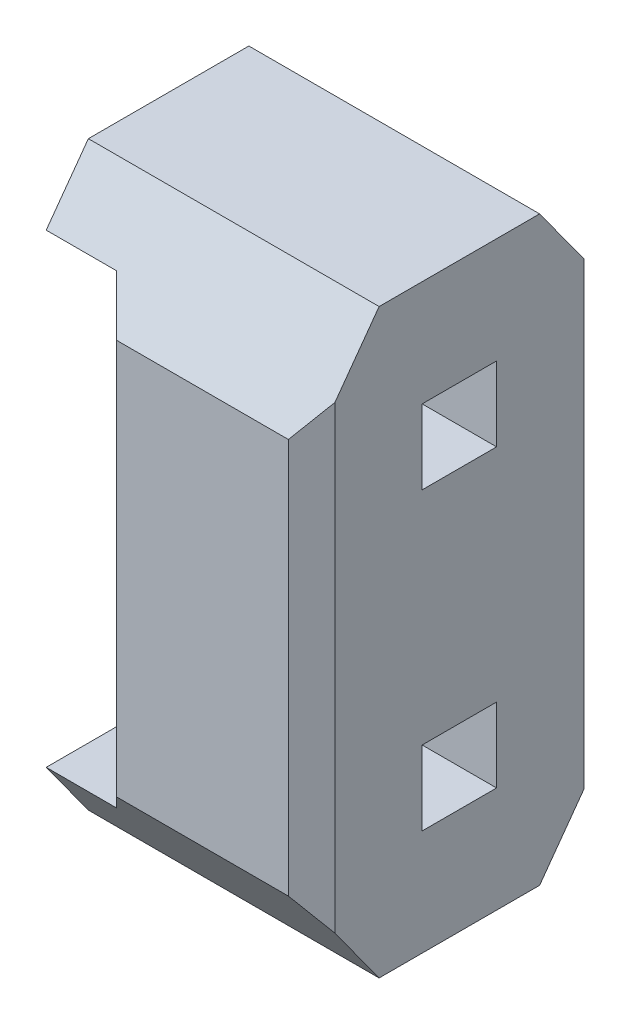
ISO-10303-21;
HEADER;
FILE_DESCRIPTION(('STEP AP214'),'2;1');
FILE_NAME('part.step','',(''),(''),'','','');
FILE_SCHEMA(('AUTOMOTIVE_DESIGN { 1 0 10303 214 1 1 1 1 }'));
ENDSEC;
DATA;
#1=APPLICATION_CONTEXT('core data for automotive mechanical design processes');
#2=APPLICATION_PROTOCOL_DEFINITION('international standard','automotive_design',2000,#1);
#3=PRODUCT_CONTEXT('',#1,'mechanical');
#4=PRODUCT('Part','Part','',(#3));
#5=PRODUCT_RELATED_PRODUCT_CATEGORY('part','',(#4));
#6=PRODUCT_DEFINITION_FORMATION('','',#4);
#7=PRODUCT_DEFINITION_CONTEXT('part definition',#1,'design');
#8=PRODUCT_DEFINITION('design','',#6,#7);
#9=PRODUCT_DEFINITION_SHAPE('','',#8);
#10=(LENGTH_UNIT() NAMED_UNIT(*) SI_UNIT(.MILLI.,.METRE.));
#11=(NAMED_UNIT(*) PLANE_ANGLE_UNIT() SI_UNIT($,.RADIAN.));
#12=(NAMED_UNIT(*) SI_UNIT($,.STERADIAN.) SOLID_ANGLE_UNIT());
#13=UNCERTAINTY_MEASURE_WITH_UNIT(LENGTH_MEASURE(1.E-05),#10,'distance_accuracy_value','');
#14=(GEOMETRIC_REPRESENTATION_CONTEXT(3) GLOBAL_UNCERTAINTY_ASSIGNED_CONTEXT((#13)) GLOBAL_UNIT_ASSIGNED_CONTEXT((#10,
#11,#12)) REPRESENTATION_CONTEXT('',''));
#15=CARTESIAN_POINT('',(0.,0.,0.));
#16=DIRECTION('',(0.,0.,1.));
#17=DIRECTION('',(1.,0.,0.));
#18=AXIS2_PLACEMENT_3D('',#15,#16,#17);
#19=CARTESIAN_POINT('',(1.25,4.6,-48.55));
#20=DIRECTION('',(0.,0.586967571460905,0.809610443394407));
#21=DIRECTION('',(0.,-0.809610443394407,0.586967571460905));
#22=AXIS2_PLACEMENT_3D('',#19,#20,#21);
#23=PLANE('',#22);
#24=DIRECTION('',(1.,0.,0.));
#25=VECTOR('',#24,1.);
#26=CARTESIAN_POINT('',(1.25,4.5,-48.4775));
#27=LINE('',#26,#25);
#28=CARTESIAN_POINT('',(0.,4.5,-48.4775));
#29=VERTEX_POINT('',#28);
#30=CARTESIAN_POINT('',(0.602500000000325,4.5,-48.4775000000001));
#31=VERTEX_POINT('',#30);
#32=EDGE_CURVE('E199',#29,#31,#27,.T.);
#33=ORIENTED_EDGE('',*,*,#32,.T.);
#34=DIRECTION('',(0.506207656348697,-0.698217457033984,0.506207656349602));
#35=VECTOR('',#34,1.);
#36=CARTESIAN_POINT('',(0.6025000000002,4.5,-48.4775));
#37=LINE('',#36,#35);
#38=CARTESIAN_POINT('',(0.819999999999671,4.2,-48.2599999999999));
#39=VERTEX_POINT('',#38);
#40=EDGE_CURVE('E197',#31,#39,#37,.T.);
#41=ORIENTED_EDGE('',*,*,#40,.T.);
#42=DIRECTION('',(1.,0.,0.));
#43=VECTOR('',#42,1.);
#44=CARTESIAN_POINT('',(1.25,4.19999999999999,-48.26));
#45=LINE('',#44,#43);
#46=CARTESIAN_POINT('',(2.30000000000012,4.2,-48.2599999999999));
#47=VERTEX_POINT('',#46);
#48=EDGE_CURVE('E20',#39,#47,#45,.T.);
#49=ORIENTED_EDGE('',*,*,#48,.T.);
#50=DIRECTION('',(0.506207656348954,0.698217457033861,-0.506207656349513));
#51=VECTOR('',#50,1.);
#52=CARTESIAN_POINT('',(2.3,4.19999999999999,-48.26));
#53=LINE('',#52,#51);
#54=CARTESIAN_POINT('',(2.49999999999988,4.47586206896592,-48.4600000000002));
#55=VERTEX_POINT('',#54);
#56=EDGE_CURVE('E181',#47,#55,#53,.T.);
#57=ORIENTED_EDGE('',*,*,#56,.T.);
#58=DIRECTION('',(0.,-0.809610443394407,0.586967571460905));
#59=VECTOR('',#58,1.);
#60=CARTESIAN_POINT('',(2.5,4.6,-48.55));
#61=LINE('',#60,#59);
#62=CARTESIAN_POINT('',(2.5,5.00000000000001,-48.84));
#63=VERTEX_POINT('',#62);
#64=EDGE_CURVE('E188',#55,#63,#61,.F.);
#65=ORIENTED_EDGE('',*,*,#64,.T.);
#66=DIRECTION('',(1.,0.,0.));
#67=VECTOR('',#66,1.);
#68=CARTESIAN_POINT('',(1.25,5.,-48.84));
#69=LINE('',#68,#67);
#70=CARTESIAN_POINT('',(0.,5.00000000000001,-48.84));
#71=VERTEX_POINT('',#70);
#72=EDGE_CURVE('E215',#71,#63,#69,.T.);
#73=ORIENTED_EDGE('',*,*,#72,.F.);
#74=DIRECTION('',(0.,-0.809610443394407,0.586967571460905));
#75=VECTOR('',#74,1.);
#76=CARTESIAN_POINT('',(0.,4.6,-48.55));
#77=LINE('',#76,#75);
#78=EDGE_CURVE('E207',#71,#29,#77,.T.);
#79=ORIENTED_EDGE('',*,*,#78,.T.);
#80=EDGE_LOOP('',(#33,#41,#49,#57,#65,#73,#79));
#81=FACE_BOUND('',#80,.T.);
#82=ADVANCED_FACE('F17',(#81),#23,.T.);
#83=CARTESIAN_POINT('',(1.25,4.6,-50.51));
#84=DIRECTION('',(0.,-0.586967571460905,0.809610443394407));
#85=DIRECTION('',(0.,-0.809610443394407,-0.586967571460905));
#86=AXIS2_PLACEMENT_3D('',#83,#84,#85);
#87=PLANE('',#86);
#88=DIRECTION('',(0.,-0.809610443394407,-0.586967571460905));
#89=VECTOR('',#88,1.);
#90=CARTESIAN_POINT('',(0.,4.6,-50.51));
#91=LINE('',#90,#89);
#92=CARTESIAN_POINT('',(0.,5.,-50.22));
#93=VERTEX_POINT('',#92);
#94=CARTESIAN_POINT('',(0.,4.5,-50.5825));
#95=VERTEX_POINT('',#94);
#96=EDGE_CURVE('E263',#93,#95,#91,.T.);
#97=ORIENTED_EDGE('',*,*,#96,.F.);
#98=DIRECTION('',(1.,0.,0.));
#99=VECTOR('',#98,1.);
#100=CARTESIAN_POINT('',(1.25,5.,-50.22));
#101=LINE('',#100,#99);
#102=CARTESIAN_POINT('',(2.5,5.,-50.22));
#103=VERTEX_POINT('',#102);
#104=EDGE_CURVE('E227',#103,#93,#101,.F.);
#105=ORIENTED_EDGE('',*,*,#104,.F.);
#106=DIRECTION('',(0.,-0.809610443394407,-0.586967571460905));
#107=VECTOR('',#106,1.);
#108=CARTESIAN_POINT('',(2.5,4.6,-50.51));
#109=LINE('',#108,#107);
#110=CARTESIAN_POINT('',(2.49999999999988,4.47586206896592,-50.5999999999998));
#111=VERTEX_POINT('',#110);
#112=EDGE_CURVE('E223',#111,#103,#109,.F.);
#113=ORIENTED_EDGE('',*,*,#112,.F.);
#114=DIRECTION('',(0.506207656348957,0.698217457033858,0.506207656349515));
#115=VECTOR('',#114,1.);
#116=CARTESIAN_POINT('',(2.3,4.19999999999999,-50.8));
#117=LINE('',#116,#115);
#118=CARTESIAN_POINT('',(2.30000000000012,4.2,-50.8000000000001));
#119=VERTEX_POINT('',#118);
#120=EDGE_CURVE('E266',#119,#111,#117,.T.);
#121=ORIENTED_EDGE('',*,*,#120,.F.);
#122=DIRECTION('',(1.,0.,0.));
#123=VECTOR('',#122,1.);
#124=CARTESIAN_POINT('',(1.25,4.19999999999999,-50.8));
#125=LINE('',#124,#123);
#126=CARTESIAN_POINT('',(0.819999999999671,4.2,-50.8000000000001));
#127=VERTEX_POINT('',#126);
#128=EDGE_CURVE('E205',#127,#119,#125,.T.);
#129=ORIENTED_EDGE('',*,*,#128,.F.);
#130=DIRECTION('',(0.506207656348699,-0.698217457033982,-0.506207656349603));
#131=VECTOR('',#130,1.);
#132=CARTESIAN_POINT('',(0.6025000000002,4.5,-50.5825));
#133=LINE('',#132,#131);
#134=CARTESIAN_POINT('',(0.602500000000326,4.5,-50.5824999999999));
#135=VERTEX_POINT('',#134);
#136=EDGE_CURVE('E203',#135,#127,#133,.T.);
#137=ORIENTED_EDGE('',*,*,#136,.F.);
#138=DIRECTION('',(1.,0.,0.));
#139=VECTOR('',#138,1.);
#140=CARTESIAN_POINT('',(1.25,4.5,-50.5825));
#141=LINE('',#140,#139);
#142=EDGE_CURVE('E261',#95,#135,#141,.T.);
#143=ORIENTED_EDGE('',*,*,#142,.F.);
#144=EDGE_LOOP('',(#97,#105,#113,#121,#129,#137,#143));
#145=FACE_BOUND('',#144,.T.);
#146=ADVANCED_FACE('F285',(#145),#87,.F.);
#147=CARTESIAN_POINT('',(1.25,0.4,-50.51));
#148=DIRECTION('',(0.,0.586967571460905,0.809610443394407));
#149=DIRECTION('',(0.,-0.809610443394407,0.586967571460905));
#150=AXIS2_PLACEMENT_3D('',#147,#148,#149);
#151=PLANE('',#150);
#152=DIRECTION('',(-0.506207656349409,0.698217457033648,-0.506207656349353));
#153=VECTOR('',#152,1.);
#154=CARTESIAN_POINT('',(2.5,0.524137931034498,-50.6));
#155=LINE('',#154,#153);
#156=CARTESIAN_POINT('',(2.49999999999988,0.5241379310345,-50.5999999999999));
#157=VERTEX_POINT('',#156);
#158=CARTESIAN_POINT('',(2.30000000000012,0.800000000000004,-50.8000000000001));
#159=VERTEX_POINT('',#158);
#160=EDGE_CURVE('E251',#157,#159,#155,.T.);
#161=ORIENTED_EDGE('',*,*,#160,.F.);
#162=DIRECTION('',(0.,-0.809610443394407,0.586967571460905));
#163=VECTOR('',#162,1.);
#164=CARTESIAN_POINT('',(2.5,0.4,-50.51));
#165=LINE('',#164,#163);
#166=CARTESIAN_POINT('',(2.5,0.,-50.22));
#167=VERTEX_POINT('',#166);
#168=EDGE_CURVE('E253',#167,#157,#165,.F.);
#169=ORIENTED_EDGE('',*,*,#168,.F.);
#170=DIRECTION('',(1.,0.,0.));
#171=VECTOR('',#170,1.);
#172=CARTESIAN_POINT('',(1.25,0.,-50.22));
#173=LINE('',#172,#171);
#174=CARTESIAN_POINT('',(0.,0.,-50.22));
#175=VERTEX_POINT('',#174);
#176=EDGE_CURVE('E288',#167,#175,#173,.F.);
#177=ORIENTED_EDGE('',*,*,#176,.T.);
#178=DIRECTION('',(0.,-0.809610443394407,0.586967571460905));
#179=VECTOR('',#178,1.);
#180=CARTESIAN_POINT('',(0.,0.4,-50.51));
#181=LINE('',#180,#179);
#182=CARTESIAN_POINT('',(0.,0.500000000000001,-50.5825));
#183=VERTEX_POINT('',#182);
#184=EDGE_CURVE('E255',#183,#175,#181,.T.);
#185=ORIENTED_EDGE('',*,*,#184,.F.);
#186=DIRECTION('',(1.,0.,0.));
#187=VECTOR('',#186,1.);
#188=CARTESIAN_POINT('',(1.25,0.500000000000003,-50.5825));
#189=LINE('',#188,#187);
#190=CARTESIAN_POINT('',(0.602500000000326,0.500000000000002,-50.5824999999999));
#191=VERTEX_POINT('',#190);
#192=EDGE_CURVE('E257',#191,#183,#189,.F.);
#193=ORIENTED_EDGE('',*,*,#192,.F.);
#194=DIRECTION('',(-0.506207656348698,-0.698217457033982,0.506207656349602));
#195=VECTOR('',#194,1.);
#196=CARTESIAN_POINT('',(0.8199999999998,0.800000000000008,-50.8));
#197=LINE('',#196,#195);
#198=CARTESIAN_POINT('',(0.819999999999671,0.800000000000004,-50.8000000000001));
#199=VERTEX_POINT('',#198);
#200=EDGE_CURVE('E259',#199,#191,#197,.T.);
#201=ORIENTED_EDGE('',*,*,#200,.F.);
#202=DIRECTION('',(1.,0.,0.));
#203=VECTOR('',#202,1.);
#204=CARTESIAN_POINT('',(1.25,0.800000000000008,-50.8));
#205=LINE('',#204,#203);
#206=EDGE_CURVE('E249',#159,#199,#205,.F.);
#207=ORIENTED_EDGE('',*,*,#206,.F.);
#208=EDGE_LOOP('',(#161,#169,#177,#185,#193,#201,#207));
#209=FACE_BOUND('',#208,.T.);
#210=ADVANCED_FACE('F431',(#209),#151,.F.);
#211=CARTESIAN_POINT('',(1.25,0.4,-48.55));
#212=DIRECTION('',(0.,-0.586967571460905,0.809610443394407));
#213=DIRECTION('',(0.,-0.809610443394407,-0.586967571460905));
#214=AXIS2_PLACEMENT_3D('',#211,#212,#213);
#215=PLANE('',#214);
#216=DIRECTION('',(1.,0.,0.));
#217=VECTOR('',#216,1.);
#218=CARTESIAN_POINT('',(1.25,0.800000000000008,-48.26));
#219=LINE('',#218,#217);
#220=CARTESIAN_POINT('',(2.30000000000012,0.800000000000004,-48.2599999999999));
#221=VERTEX_POINT('',#220);
#222=CARTESIAN_POINT('',(0.819999999999671,0.800000000000004,-48.2599999999999));
#223=VERTEX_POINT('',#222);
#224=EDGE_CURVE('E191',#221,#223,#219,.F.);
#225=ORIENTED_EDGE('',*,*,#224,.T.);
#226=DIRECTION('',(-0.506207656348696,-0.698217457033985,-0.506207656349601));
#227=VECTOR('',#226,1.);
#228=CARTESIAN_POINT('',(0.8199999999998,0.800000000000008,-48.26));
#229=LINE('',#228,#227);
#230=CARTESIAN_POINT('',(0.602500000000324,0.5,-48.4775000000001));
#231=VERTEX_POINT('',#230);
#232=EDGE_CURVE('E232',#223,#231,#229,.T.);
#233=ORIENTED_EDGE('',*,*,#232,.T.);
#234=DIRECTION('',(1.,0.,0.));
#235=VECTOR('',#234,1.);
#236=CARTESIAN_POINT('',(1.25,0.500000000000001,-48.4775));
#237=LINE('',#236,#235);
#238=CARTESIAN_POINT('',(0.,0.5,-48.4775));
#239=VERTEX_POINT('',#238);
#240=EDGE_CURVE('E246',#231,#239,#237,.F.);
#241=ORIENTED_EDGE('',*,*,#240,.T.);
#242=DIRECTION('',(0.,-0.809610443394407,-0.586967571460905));
#243=VECTOR('',#242,1.);
#244=CARTESIAN_POINT('',(0.,0.4,-48.55));
#245=LINE('',#244,#243);
#246=CARTESIAN_POINT('',(0.,0.,-48.84));
#247=VERTEX_POINT('',#246);
#248=EDGE_CURVE('E244',#239,#247,#245,.T.);
#249=ORIENTED_EDGE('',*,*,#248,.T.);
#250=DIRECTION('',(1.,0.,0.));
#251=VECTOR('',#250,1.);
#252=CARTESIAN_POINT('',(1.25,0.,-48.84));
#253=LINE('',#252,#251);
#254=CARTESIAN_POINT('',(2.5,0.,-48.84));
#255=VERTEX_POINT('',#254);
#256=EDGE_CURVE('E293',#247,#255,#253,.T.);
#257=ORIENTED_EDGE('',*,*,#256,.T.);
#258=DIRECTION('',(0.,-0.809610443394407,-0.586967571460905));
#259=VECTOR('',#258,1.);
#260=CARTESIAN_POINT('',(2.5,0.4,-48.55));
#261=LINE('',#260,#259);
#262=CARTESIAN_POINT('',(2.49999999999988,0.524137931034496,-48.4600000000001));
#263=VERTEX_POINT('',#262);
#264=EDGE_CURVE('E241',#255,#263,#261,.F.);
#265=ORIENTED_EDGE('',*,*,#264,.T.);
#266=DIRECTION('',(-0.5062076563494,0.698217457033649,0.506207656349361));
#267=VECTOR('',#266,1.);
#268=CARTESIAN_POINT('',(2.5,0.524137931034493,-48.46));
#269=LINE('',#268,#267);
#270=EDGE_CURVE('E239',#263,#221,#269,.T.);
#271=ORIENTED_EDGE('',*,*,#270,.T.);
#272=EDGE_LOOP('',(#225,#233,#241,#249,#257,#265,#271));
#273=FACE_BOUND('',#272,.T.);
#274=ADVANCED_FACE('F421',(#273),#215,.T.);
#275=CARTESIAN_POINT('',(1.25,5.,-49.53));
#276=DIRECTION('',(0.,1.,0.));
#277=DIRECTION('',(0.,0.,1.));
#278=AXIS2_PLACEMENT_3D('',#275,#276,#277);
#279=PLANE('',#278);
#280=ORIENTED_EDGE('',*,*,#104,.T.);
#281=DIRECTION('',(0.,0.,-1.));
#282=VECTOR('',#281,1.);
#283=CARTESIAN_POINT('',(0.,5.,-49.53));
#284=LINE('',#283,#282);
#285=EDGE_CURVE('E231',#93,#71,#284,.F.);
#286=ORIENTED_EDGE('',*,*,#285,.T.);
#287=ORIENTED_EDGE('',*,*,#72,.T.);
#288=DIRECTION('',(0.,0.,1.));
#289=VECTOR('',#288,1.);
#290=CARTESIAN_POINT('',(2.5,5.,-49.53));
#291=LINE('',#290,#289);
#292=EDGE_CURVE('E219',#63,#103,#291,.F.);
#293=ORIENTED_EDGE('',*,*,#292,.T.);
#294=EDGE_LOOP('',(#280,#286,#287,#293));
#295=FACE_BOUND('',#294,.T.);
#296=ADVANCED_FACE('F229',(#295),#279,.T.);
#297=CARTESIAN_POINT('',(1.25,0.,-49.53));
#298=DIRECTION('',(0.,1.,0.));
#299=DIRECTION('',(0.,0.,1.));
#300=AXIS2_PLACEMENT_3D('',#297,#298,#299);
#301=PLANE('',#300);
#302=DIRECTION('',(0.,0.,-1.));
#303=VECTOR('',#302,1.);
#304=CARTESIAN_POINT('',(0.,0.,-49.53));
#305=LINE('',#304,#303);
#306=EDGE_CURVE('E297',#247,#175,#305,.T.);
#307=ORIENTED_EDGE('',*,*,#306,.T.);
#308=ORIENTED_EDGE('',*,*,#176,.F.);
#309=DIRECTION('',(0.,0.,1.));
#310=VECTOR('',#309,1.);
#311=CARTESIAN_POINT('',(2.5,0.,-49.53));
#312=LINE('',#311,#310);
#313=EDGE_CURVE('E287',#255,#167,#312,.F.);
#314=ORIENTED_EDGE('',*,*,#313,.F.);
#315=ORIENTED_EDGE('',*,*,#256,.F.);
#316=EDGE_LOOP('',(#307,#308,#314,#315));
#317=FACE_BOUND('',#316,.T.);
#318=ADVANCED_FACE('F428',(#317),#301,.F.);
#319=CARTESIAN_POINT('',(0.,4.75,-49.53));
#320=DIRECTION('',(1.,0.,0.));
#321=DIRECTION('',(0.,0.,-1.));
#322=AXIS2_PLACEMENT_3D('',#319,#320,#321);
#323=PLANE('',#322);
#324=ORIENTED_EDGE('',*,*,#285,.F.);
#325=ORIENTED_EDGE('',*,*,#96,.T.);
#326=DIRECTION('',(0.,0.,1.));
#327=VECTOR('',#326,1.);
#328=CARTESIAN_POINT('',(0.,4.5,-49.53));
#329=LINE('',#328,#327);
#330=EDGE_CURVE('E307',#95,#29,#329,.T.);
#331=ORIENTED_EDGE('',*,*,#330,.T.);
#332=ORIENTED_EDGE('',*,*,#78,.F.);
#333=EDGE_LOOP('',(#324,#325,#331,#332));
#334=FACE_BOUND('',#333,.T.);
#335=ADVANCED_FACE('F441',(#334),#323,.F.);
#336=CARTESIAN_POINT('',(0.,0.25,-49.53));
#337=DIRECTION('',(1.,0.,0.));
#338=DIRECTION('',(0.,0.,-1.));
#339=AXIS2_PLACEMENT_3D('',#336,#337,#338);
#340=PLANE('',#339);
#341=ORIENTED_EDGE('',*,*,#306,.F.);
#342=ORIENTED_EDGE('',*,*,#248,.F.);
#343=DIRECTION('',(0.,0.,1.));
#344=VECTOR('',#343,1.);
#345=CARTESIAN_POINT('',(0.,0.5,-49.53));
#346=LINE('',#345,#344);
#347=EDGE_CURVE('E315',#183,#239,#346,.T.);
#348=ORIENTED_EDGE('',*,*,#347,.F.);
#349=ORIENTED_EDGE('',*,*,#184,.T.);
#350=EDGE_LOOP('',(#341,#342,#348,#349));
#351=FACE_BOUND('',#350,.T.);
#352=ADVANCED_FACE('F443',(#351),#340,.F.);
#353=CARTESIAN_POINT('',(1.55,3.45,-49.53));
#354=DIRECTION('',(0.,1.,0.));
#355=DIRECTION('',(0.,0.,1.));
#356=AXIS2_PLACEMENT_3D('',#353,#354,#355);
#357=PLANE('',#356);
#358=DIRECTION('',(1.,0.,0.));
#359=VECTOR('',#358,1.);
#360=CARTESIAN_POINT('',(1.55,3.45,-49.85));
#361=LINE('',#360,#359);
#362=CARTESIAN_POINT('',(0.6,3.45,-49.85));
#363=VERTEX_POINT('',#362);
#364=CARTESIAN_POINT('',(2.5,3.45,-49.85));
#365=VERTEX_POINT('',#364);
#366=EDGE_CURVE('E332',#363,#365,#361,.T.);
#367=ORIENTED_EDGE('',*,*,#366,.F.);
#368=DIRECTION('',(0.,0.,1.));
#369=VECTOR('',#368,1.);
#370=CARTESIAN_POINT('',(0.6,3.45,-49.53));
#371=LINE('',#370,#369);
#372=CARTESIAN_POINT('',(0.6,3.45,-49.21));
#373=VERTEX_POINT('',#372);
#374=EDGE_CURVE('E302',#363,#373,#371,.T.);
#375=ORIENTED_EDGE('',*,*,#374,.T.);
#376=DIRECTION('',(1.,0.,0.));
#377=VECTOR('',#376,1.);
#378=CARTESIAN_POINT('',(1.55,3.45,-49.21));
#379=LINE('',#378,#377);
#380=CARTESIAN_POINT('',(2.5,3.45,-49.21));
#381=VERTEX_POINT('',#380);
#382=EDGE_CURVE('E327',#373,#381,#379,.T.);
#383=ORIENTED_EDGE('',*,*,#382,.T.);
#384=DIRECTION('',(0.,0.,1.));
#385=VECTOR('',#384,1.);
#386=CARTESIAN_POINT('',(2.5,3.45,-49.53));
#387=LINE('',#386,#385);
#388=EDGE_CURVE('E300',#381,#365,#387,.F.);
#389=ORIENTED_EDGE('',*,*,#388,.T.);
#390=EDGE_LOOP('',(#367,#375,#383,#389));
#391=FACE_BOUND('',#390,.T.);
#392=ADVANCED_FACE('F398',(#391),#357,.T.);
#393=CARTESIAN_POINT('',(0.71,2.5,-50.69));
#394=DIRECTION('',(0.707106781190498,0.,0.707106781182598));
#395=DIRECTION('',(0.707106781182598,0.,-0.707106781190498));
#396=AXIS2_PLACEMENT_3D('',#393,#394,#395);
#397=PLANE('',#396);
#398=ORIENTED_EDGE('',*,*,#200,.T.);
#399=DIRECTION('',(0.70710678118618,0.,-0.707106781186916));
#400=VECTOR('',#399,1.);
#401=CARTESIAN_POINT('',(0.6000000000002,0.5,-50.58));
#402=LINE('',#401,#400);
#403=CARTESIAN_POINT('',(0.600000000000408,0.5,-50.5799999999997));
#404=VERTEX_POINT('',#403);
#405=EDGE_CURVE('E312',#404,#191,#402,.T.);
#406=ORIENTED_EDGE('',*,*,#405,.F.);
#407=DIRECTION('',(0.,1.,0.));
#408=VECTOR('',#407,1.);
#409=CARTESIAN_POINT('',(0.6,2.5,-50.58));
#410=LINE('',#409,#408);
#411=CARTESIAN_POINT('',(0.600000000000408,4.5,-50.5799999999997));
#412=VERTEX_POINT('',#411);
#413=EDGE_CURVE('E337',#404,#412,#410,.T.);
#414=ORIENTED_EDGE('',*,*,#413,.T.);
#415=DIRECTION('',(0.70710678118618,0.,-0.707106781186916));
#416=VECTOR('',#415,1.);
#417=CARTESIAN_POINT('',(0.6000000000002,4.5,-50.58));
#418=LINE('',#417,#416);
#419=EDGE_CURVE('E304',#412,#135,#418,.T.);
#420=ORIENTED_EDGE('',*,*,#419,.T.);
#421=ORIENTED_EDGE('',*,*,#136,.T.);
#422=DIRECTION('',(0.,1.,0.));
#423=VECTOR('',#422,1.);
#424=CARTESIAN_POINT('',(0.8199999999998,2.5,-50.8));
#425=LINE('',#424,#423);
#426=EDGE_CURVE('E275',#127,#199,#425,.F.);
#427=ORIENTED_EDGE('',*,*,#426,.T.);
#428=EDGE_LOOP('',(#398,#406,#414,#420,#421,#427));
#429=FACE_BOUND('',#428,.T.);
#430=ADVANCED_FACE('F435',(#429),#397,.F.);
#431=CARTESIAN_POINT('',(0.30125,4.5,-49.53));
#432=DIRECTION('',(0.,1.,0.));
#433=DIRECTION('',(0.,0.,1.));
#434=AXIS2_PLACEMENT_3D('',#431,#432,#433);
#435=PLANE('',#434);
#436=ORIENTED_EDGE('',*,*,#142,.T.);
#437=ORIENTED_EDGE('',*,*,#419,.F.);
#438=DIRECTION('',(0.,0.,-1.));
#439=VECTOR('',#438,1.);
#440=CARTESIAN_POINT('',(0.6,4.5,-49.53));
#441=LINE('',#440,#439);
#442=CARTESIAN_POINT('',(0.600000000000279,4.5,-48.4800000000001));
#443=VERTEX_POINT('',#442);
#444=EDGE_CURVE('E339',#412,#443,#441,.F.);
#445=ORIENTED_EDGE('',*,*,#444,.T.);
#446=DIRECTION('',(-0.707106781182598,0.,-0.707106781190498));
#447=VECTOR('',#446,1.);
#448=CARTESIAN_POINT('',(0.71,4.5,-48.37));
#449=LINE('',#448,#447);
#450=EDGE_CURVE('E310',#443,#31,#449,.F.);
#451=ORIENTED_EDGE('',*,*,#450,.T.);
#452=ORIENTED_EDGE('',*,*,#32,.F.);
#453=ORIENTED_EDGE('',*,*,#330,.F.);
#454=EDGE_LOOP('',(#436,#437,#445,#451,#452,#453));
#455=FACE_BOUND('',#454,.T.);
#456=ADVANCED_FACE('F439',(#455),#435,.F.);
#457=CARTESIAN_POINT('',(0.71,2.5,-48.37));
#458=DIRECTION('',(0.707106781190498,0.,-0.707106781182598));
#459=DIRECTION('',(-0.707106781182598,0.,-0.707106781190498));
#460=AXIS2_PLACEMENT_3D('',#457,#458,#459);
#461=PLANE('',#460);
#462=ORIENTED_EDGE('',*,*,#232,.F.);
#463=DIRECTION('',(0.,1.,0.));
#464=VECTOR('',#463,1.);
#465=CARTESIAN_POINT('',(0.8199999999998,2.5,-48.26));
#466=LINE('',#465,#464);
#467=EDGE_CURVE('E325',#39,#223,#466,.F.);
#468=ORIENTED_EDGE('',*,*,#467,.F.);
#469=ORIENTED_EDGE('',*,*,#40,.F.);
#470=ORIENTED_EDGE('',*,*,#450,.F.);
#471=DIRECTION('',(0.,1.,0.));
#472=VECTOR('',#471,1.);
#473=CARTESIAN_POINT('',(0.6,2.5,-48.48));
#474=LINE('',#473,#472);
#475=CARTESIAN_POINT('',(0.600000000000408,0.5,-48.4800000000003));
#476=VERTEX_POINT('',#475);
#477=EDGE_CURVE('E341',#443,#476,#474,.F.);
#478=ORIENTED_EDGE('',*,*,#477,.T.);
#479=DIRECTION('',(-0.707106781187161,0.,-0.707106781185934));
#480=VECTOR('',#479,1.);
#481=CARTESIAN_POINT('',(0.6025000000002,0.5,-48.4775));
#482=LINE('',#481,#480);
#483=EDGE_CURVE('E318',#231,#476,#482,.T.);
#484=ORIENTED_EDGE('',*,*,#483,.F.);
#485=EDGE_LOOP('',(#462,#468,#469,#470,#478,#484));
#486=FACE_BOUND('',#485,.T.);
#487=ADVANCED_FACE('F416',(#486),#461,.F.);
#488=CARTESIAN_POINT('',(0.30125,0.5,-49.53));
#489=DIRECTION('',(0.,1.,0.));
#490=DIRECTION('',(0.,0.,1.));
#491=AXIS2_PLACEMENT_3D('',#488,#489,#490);
#492=PLANE('',#491);
#493=ORIENTED_EDGE('',*,*,#483,.T.);
#494=DIRECTION('',(0.,0.,-1.));
#495=VECTOR('',#494,1.);
#496=CARTESIAN_POINT('',(0.6,0.5,-49.53));
#497=LINE('',#496,#495);
#498=EDGE_CURVE('E343',#476,#404,#497,.T.);
#499=ORIENTED_EDGE('',*,*,#498,.T.);
#500=ORIENTED_EDGE('',*,*,#405,.T.);
#501=ORIENTED_EDGE('',*,*,#192,.T.);
#502=ORIENTED_EDGE('',*,*,#347,.T.);
#503=ORIENTED_EDGE('',*,*,#240,.F.);
#504=EDGE_LOOP('',(#493,#499,#500,#501,#502,#503));
#505=FACE_BOUND('',#504,.T.);
#506=ADVANCED_FACE('F418',(#505),#492,.T.);
#507=CARTESIAN_POINT('',(1.55,1.23,-49.85));
#508=DIRECTION('',(0.,0.,1.));
#509=DIRECTION('',(1.,0.,0.));
#510=AXIS2_PLACEMENT_3D('',#507,#508,#509);
#511=PLANE('',#510);
#512=DIRECTION('',(1.,0.,0.));
#513=VECTOR('',#512,1.);
#514=CARTESIAN_POINT('',(1.55,1.55,-49.85));
#515=LINE('',#514,#513);
#516=CARTESIAN_POINT('',(2.5,1.55,-49.85));
#517=VERTEX_POINT('',#516);
#518=CARTESIAN_POINT('',(0.6,1.55,-49.85));
#519=VERTEX_POINT('',#518);
#520=EDGE_CURVE('E283',#517,#519,#515,.F.);
#521=ORIENTED_EDGE('',*,*,#520,.T.);
#522=DIRECTION('',(0.,1.,0.));
#523=VECTOR('',#522,1.);
#524=CARTESIAN_POINT('',(0.6,2.5,-49.85));
#525=LINE('',#524,#523);
#526=CARTESIAN_POINT('',(0.6,0.91,-49.85));
#527=VERTEX_POINT('',#526);
#528=EDGE_CURVE('E346',#519,#527,#525,.F.);
#529=ORIENTED_EDGE('',*,*,#528,.T.);
#530=DIRECTION('',(1.,0.,0.));
#531=VECTOR('',#530,1.);
#532=CARTESIAN_POINT('',(1.55,0.91,-49.85));
#533=LINE('',#532,#531);
#534=CARTESIAN_POINT('',(2.5,0.91,-49.85));
#535=VERTEX_POINT('',#534);
#536=EDGE_CURVE('E354',#535,#527,#533,.F.);
#537=ORIENTED_EDGE('',*,*,#536,.F.);
#538=DIRECTION('',(0.,1.,0.));
#539=VECTOR('',#538,1.);
#540=CARTESIAN_POINT('',(2.5,1.23,-49.85));
#541=LINE('',#540,#539);
#542=EDGE_CURVE('E321',#535,#517,#541,.T.);
#543=ORIENTED_EDGE('',*,*,#542,.T.);
#544=EDGE_LOOP('',(#521,#529,#537,#543));
#545=FACE_BOUND('',#544,.T.);
#546=ADVANCED_FACE('F483',(#545),#511,.T.);
#547=CARTESIAN_POINT('',(1.56,2.5,-50.8));
#548=DIRECTION('',(0.,0.,1.));
#549=DIRECTION('',(1.,0.,0.));
#550=AXIS2_PLACEMENT_3D('',#547,#548,#549);
#551=PLANE('',#550);
#552=DIRECTION('',(0.,1.,0.));
#553=VECTOR('',#552,1.);
#554=CARTESIAN_POINT('',(2.30000000000047,2.5,-50.8000000000005));
#555=LINE('',#554,#553);
#556=EDGE_CURVE('E193',#159,#119,#555,.T.);
#557=ORIENTED_EDGE('',*,*,#556,.F.);
#558=ORIENTED_EDGE('',*,*,#206,.T.);
#559=ORIENTED_EDGE('',*,*,#426,.F.);
#560=ORIENTED_EDGE('',*,*,#128,.T.);
#561=EDGE_LOOP('',(#557,#558,#559,#560));
#562=FACE_BOUND('',#561,.T.);
#563=ADVANCED_FACE('F272',(#562),#551,.F.);
#564=CARTESIAN_POINT('',(1.56,2.5,-48.26));
#565=DIRECTION('',(0.,0.,1.));
#566=DIRECTION('',(1.,0.,0.));
#567=AXIS2_PLACEMENT_3D('',#564,#565,#566);
#568=PLANE('',#567);
#569=ORIENTED_EDGE('',*,*,#48,.F.);
#570=ORIENTED_EDGE('',*,*,#467,.T.);
#571=ORIENTED_EDGE('',*,*,#224,.F.);
#572=DIRECTION('',(0.,1.,0.));
#573=VECTOR('',#572,1.);
#574=CARTESIAN_POINT('',(2.30000000000047,2.5,-48.2599999999995));
#575=LINE('',#574,#573);
#576=EDGE_CURVE('E183',#47,#221,#575,.F.);
#577=ORIENTED_EDGE('',*,*,#576,.F.);
#578=EDGE_LOOP('',(#569,#570,#571,#577));
#579=FACE_BOUND('',#578,.T.);
#580=ADVANCED_FACE('F189',(#579),#568,.T.);
#581=CARTESIAN_POINT('',(1.55,3.77,-49.21));
#582=DIRECTION('',(0.,0.,1.));
#583=DIRECTION('',(1.,0.,0.));
#584=AXIS2_PLACEMENT_3D('',#581,#582,#583);
#585=PLANE('',#584);
#586=DIRECTION('',(0.,1.,0.));
#587=VECTOR('',#586,1.);
#588=CARTESIAN_POINT('',(2.5,3.77,-49.21));
#589=LINE('',#588,#587);
#590=CARTESIAN_POINT('',(2.5,4.09,-49.21));
#591=VERTEX_POINT('',#590);
#592=EDGE_CURVE('E330',#381,#591,#589,.T.);
#593=ORIENTED_EDGE('',*,*,#592,.F.);
#594=ORIENTED_EDGE('',*,*,#382,.F.);
#595=DIRECTION('',(0.,1.,0.));
#596=VECTOR('',#595,1.);
#597=CARTESIAN_POINT('',(0.6,2.5,-49.21));
#598=LINE('',#597,#596);
#599=CARTESIAN_POINT('',(0.6,4.09,-49.21));
#600=VERTEX_POINT('',#599);
#601=EDGE_CURVE('E351',#373,#600,#598,.T.);
#602=ORIENTED_EDGE('',*,*,#601,.T.);
#603=DIRECTION('',(1.,0.,0.));
#604=VECTOR('',#603,1.);
#605=CARTESIAN_POINT('',(1.55,4.09,-49.21));
#606=LINE('',#605,#604);
#607=EDGE_CURVE('E368',#600,#591,#606,.T.);
#608=ORIENTED_EDGE('',*,*,#607,.T.);
#609=EDGE_LOOP('',(#593,#594,#602,#608));
#610=FACE_BOUND('',#609,.T.);
#611=ADVANCED_FACE('F402',(#610),#585,.F.);
#612=CARTESIAN_POINT('',(1.55,3.77,-49.85));
#613=DIRECTION('',(0.,0.,1.));
#614=DIRECTION('',(1.,0.,0.));
#615=AXIS2_PLACEMENT_3D('',#612,#613,#614);
#616=PLANE('',#615);
#617=DIRECTION('',(1.,0.,0.));
#618=VECTOR('',#617,1.);
#619=CARTESIAN_POINT('',(1.55,4.09,-49.85));
#620=LINE('',#619,#618);
#621=CARTESIAN_POINT('',(2.5,4.09,-49.85));
#622=VERTEX_POINT('',#621);
#623=CARTESIAN_POINT('',(0.6,4.09,-49.85));
#624=VERTEX_POINT('',#623);
#625=EDGE_CURVE('E371',#622,#624,#620,.F.);
#626=ORIENTED_EDGE('',*,*,#625,.T.);
#627=DIRECTION('',(0.,1.,0.));
#628=VECTOR('',#627,1.);
#629=CARTESIAN_POINT('',(0.6,2.5,-49.85));
#630=LINE('',#629,#628);
#631=EDGE_CURVE('E348',#624,#363,#630,.F.);
#632=ORIENTED_EDGE('',*,*,#631,.T.);
#633=ORIENTED_EDGE('',*,*,#366,.T.);
#634=DIRECTION('',(0.,1.,0.));
#635=VECTOR('',#634,1.);
#636=CARTESIAN_POINT('',(2.5,3.77,-49.85));
#637=LINE('',#636,#635);
#638=EDGE_CURVE('E335',#365,#622,#637,.T.);
#639=ORIENTED_EDGE('',*,*,#638,.T.);
#640=EDGE_LOOP('',(#626,#632,#633,#639));
#641=FACE_BOUND('',#640,.T.);
#642=ADVANCED_FACE('F395',(#641),#616,.T.);
#643=CARTESIAN_POINT('',(0.6,2.5,-49.53));
#644=DIRECTION('',(1.,0.,0.));
#645=DIRECTION('',(0.,0.,-1.));
#646=AXIS2_PLACEMENT_3D('',#643,#644,#645);
#647=PLANE('',#646);
#648=ORIENTED_EDGE('',*,*,#374,.F.);
#649=ORIENTED_EDGE('',*,*,#631,.F.);
#650=DIRECTION('',(0.,0.,1.));
#651=VECTOR('',#650,1.);
#652=CARTESIAN_POINT('',(0.6,4.09,-49.53));
#653=LINE('',#652,#651);
#654=EDGE_CURVE('E192',#624,#600,#653,.T.);
#655=ORIENTED_EDGE('',*,*,#654,.T.);
#656=ORIENTED_EDGE('',*,*,#601,.F.);
#657=EDGE_LOOP('',(#648,#649,#655,#656));
#658=FACE_BOUND('',#657,.T.);
#659=ORIENTED_EDGE('',*,*,#528,.F.);
#660=DIRECTION('',(0.,0.,1.));
#661=VECTOR('',#660,1.);
#662=CARTESIAN_POINT('',(0.6,1.55,-49.53));
#663=LINE('',#662,#661);
#664=CARTESIAN_POINT('',(0.6,1.55,-49.21));
#665=VERTEX_POINT('',#664);
#666=EDGE_CURVE('E360',#519,#665,#663,.T.);
#667=ORIENTED_EDGE('',*,*,#666,.T.);
#668=DIRECTION('',(0.,1.,0.));
#669=VECTOR('',#668,1.);
#670=CARTESIAN_POINT('',(0.6,1.23,-49.21));
#671=LINE('',#670,#669);
#672=CARTESIAN_POINT('',(0.6,0.91,-49.21));
#673=VERTEX_POINT('',#672);
#674=EDGE_CURVE('E374',#665,#673,#671,.F.);
#675=ORIENTED_EDGE('',*,*,#674,.T.);
#676=DIRECTION('',(0.,0.,1.));
#677=VECTOR('',#676,1.);
#678=CARTESIAN_POINT('',(0.6,0.91,-49.53));
#679=LINE('',#678,#677);
#680=EDGE_CURVE('E357',#527,#673,#679,.T.);
#681=ORIENTED_EDGE('',*,*,#680,.F.);
#682=EDGE_LOOP('',(#659,#667,#675,#681));
#683=FACE_BOUND('',#682,.T.);
#684=ORIENTED_EDGE('',*,*,#477,.F.);
#685=ORIENTED_EDGE('',*,*,#444,.F.);
#686=ORIENTED_EDGE('',*,*,#413,.F.);
#687=ORIENTED_EDGE('',*,*,#498,.F.);
#688=EDGE_LOOP('',(#684,#685,#686,#687));
#689=FACE_BOUND('',#688,.T.);
#690=ADVANCED_FACE('F404',(#658,#683,#689),#647,.F.);
#691=CARTESIAN_POINT('',(1.55,0.91,-49.53));
#692=DIRECTION('',(0.,1.,0.));
#693=DIRECTION('',(0.,0.,1.));
#694=AXIS2_PLACEMENT_3D('',#691,#692,#693);
#695=PLANE('',#694);
#696=ORIENTED_EDGE('',*,*,#536,.T.);
#697=ORIENTED_EDGE('',*,*,#680,.T.);
#698=DIRECTION('',(1.,0.,0.));
#699=VECTOR('',#698,1.);
#700=CARTESIAN_POINT('',(1.55,0.91,-49.21));
#701=LINE('',#700,#699);
#702=CARTESIAN_POINT('',(2.5,0.91,-49.21));
#703=VERTEX_POINT('',#702);
#704=EDGE_CURVE('E376',#673,#703,#701,.T.);
#705=ORIENTED_EDGE('',*,*,#704,.T.);
#706=DIRECTION('',(0.,0.,1.));
#707=VECTOR('',#706,1.);
#708=CARTESIAN_POINT('',(2.5,0.91,-49.53));
#709=LINE('',#708,#707);
#710=EDGE_CURVE('E34',#703,#535,#709,.F.);
#711=ORIENTED_EDGE('',*,*,#710,.T.);
#712=EDGE_LOOP('',(#696,#697,#705,#711));
#713=FACE_BOUND('',#712,.T.);
#714=ADVANCED_FACE('F407',(#713),#695,.T.);
#715=CARTESIAN_POINT('',(1.55,1.55,-49.53));
#716=DIRECTION('',(0.,1.,0.));
#717=DIRECTION('',(0.,0.,1.));
#718=AXIS2_PLACEMENT_3D('',#715,#716,#717);
#719=PLANE('',#718);
#720=DIRECTION('',(0.,0.,1.));
#721=VECTOR('',#720,1.);
#722=CARTESIAN_POINT('',(2.5,1.55,-49.53));
#723=LINE('',#722,#721);
#724=CARTESIAN_POINT('',(2.5,1.55,-49.21));
#725=VERTEX_POINT('',#724);
#726=EDGE_CURVE('E362',#725,#517,#723,.F.);
#727=ORIENTED_EDGE('',*,*,#726,.F.);
#728=DIRECTION('',(1.,0.,0.));
#729=VECTOR('',#728,1.);
#730=CARTESIAN_POINT('',(1.55,1.55,-49.21));
#731=LINE('',#730,#729);
#732=EDGE_CURVE('E378',#725,#665,#731,.F.);
#733=ORIENTED_EDGE('',*,*,#732,.T.);
#734=ORIENTED_EDGE('',*,*,#666,.F.);
#735=ORIENTED_EDGE('',*,*,#520,.F.);
#736=EDGE_LOOP('',(#727,#733,#734,#735));
#737=FACE_BOUND('',#736,.T.);
#738=ADVANCED_FACE('F468',(#737),#719,.F.);
#739=CARTESIAN_POINT('',(2.4,2.5,-50.7));
#740=DIRECTION('',(0.707106781189898,0.,-0.707106781183198));
#741=DIRECTION('',(-0.707106781183198,0.,-0.707106781189898));
#742=AXIS2_PLACEMENT_3D('',#739,#740,#741);
#743=PLANE('',#742);
#744=DIRECTION('',(0.,1.,0.));
#745=VECTOR('',#744,1.);
#746=CARTESIAN_POINT('',(2.5,2.5,-50.6));
#747=LINE('',#746,#745);
#748=EDGE_CURVE('E381',#157,#111,#747,.T.);
#749=ORIENTED_EDGE('',*,*,#748,.F.);
#750=ORIENTED_EDGE('',*,*,#160,.T.);
#751=ORIENTED_EDGE('',*,*,#556,.T.);
#752=ORIENTED_EDGE('',*,*,#120,.T.);
#753=EDGE_LOOP('',(#749,#750,#751,#752));
#754=FACE_BOUND('',#753,.T.);
#755=ADVANCED_FACE('F281',(#754),#743,.T.);
#756=CARTESIAN_POINT('',(2.4,2.5,-48.36));
#757=DIRECTION('',(0.707106781189898,0.,0.707106781183198));
#758=DIRECTION('',(0.707106781183198,0.,-0.707106781189898));
#759=AXIS2_PLACEMENT_3D('',#756,#757,#758);
#760=PLANE('',#759);
#761=DIRECTION('',(0.,1.,0.));
#762=VECTOR('',#761,1.);
#763=CARTESIAN_POINT('',(2.5,2.5,-48.46));
#764=LINE('',#763,#762);
#765=EDGE_CURVE('E186',#55,#263,#764,.F.);
#766=ORIENTED_EDGE('',*,*,#765,.F.);
#767=ORIENTED_EDGE('',*,*,#56,.F.);
#768=ORIENTED_EDGE('',*,*,#576,.T.);
#769=ORIENTED_EDGE('',*,*,#270,.F.);
#770=EDGE_LOOP('',(#766,#767,#768,#769));
#771=FACE_BOUND('',#770,.T.);
#772=ADVANCED_FACE('F182',(#771),#760,.T.);
#773=CARTESIAN_POINT('',(1.55,4.09,-49.53));
#774=DIRECTION('',(0.,1.,0.));
#775=DIRECTION('',(0.,0.,1.));
#776=AXIS2_PLACEMENT_3D('',#773,#774,#775);
#777=PLANE('',#776);
#778=DIRECTION('',(0.,0.,-1.));
#779=VECTOR('',#778,1.);
#780=CARTESIAN_POINT('',(2.5,4.09,-49.53));
#781=LINE('',#780,#779);
#782=EDGE_CURVE('E26',#591,#622,#781,.T.);
#783=ORIENTED_EDGE('',*,*,#782,.F.);
#784=ORIENTED_EDGE('',*,*,#607,.F.);
#785=ORIENTED_EDGE('',*,*,#654,.F.);
#786=ORIENTED_EDGE('',*,*,#625,.F.);
#787=EDGE_LOOP('',(#783,#784,#785,#786));
#788=FACE_BOUND('',#787,.T.);
#789=ADVANCED_FACE('F392',(#788),#777,.F.);
#790=CARTESIAN_POINT('',(1.55,1.23,-49.21));
#791=DIRECTION('',(0.,0.,1.));
#792=DIRECTION('',(1.,0.,0.));
#793=AXIS2_PLACEMENT_3D('',#790,#791,#792);
#794=PLANE('',#793);
#795=DIRECTION('',(0.,1.,0.));
#796=VECTOR('',#795,1.);
#797=CARTESIAN_POINT('',(2.5,2.5,-49.21));
#798=LINE('',#797,#796);
#799=EDGE_CURVE('E11',#703,#725,#798,.T.);
#800=ORIENTED_EDGE('',*,*,#799,.F.);
#801=ORIENTED_EDGE('',*,*,#704,.F.);
#802=ORIENTED_EDGE('',*,*,#674,.F.);
#803=ORIENTED_EDGE('',*,*,#732,.F.);
#804=EDGE_LOOP('',(#800,#801,#802,#803));
#805=FACE_BOUND('',#804,.T.);
#806=ADVANCED_FACE('F454',(#805),#794,.F.);
#807=CARTESIAN_POINT('',(2.5,2.5,-49.53));
#808=DIRECTION('',(1.,0.,0.));
#809=DIRECTION('',(0.,0.,-1.));
#810=AXIS2_PLACEMENT_3D('',#807,#808,#809);
#811=PLANE('',#810);
#812=ORIENTED_EDGE('',*,*,#710,.F.);
#813=ORIENTED_EDGE('',*,*,#799,.T.);
#814=ORIENTED_EDGE('',*,*,#726,.T.);
#815=ORIENTED_EDGE('',*,*,#542,.F.);
#816=EDGE_LOOP('',(#812,#813,#814,#815));
#817=FACE_BOUND('',#816,.T.);
#818=ORIENTED_EDGE('',*,*,#592,.T.);
#819=ORIENTED_EDGE('',*,*,#782,.T.);
#820=ORIENTED_EDGE('',*,*,#638,.F.);
#821=ORIENTED_EDGE('',*,*,#388,.F.);
#822=EDGE_LOOP('',(#818,#819,#820,#821));
#823=FACE_BOUND('',#822,.T.);
#824=ORIENTED_EDGE('',*,*,#64,.F.);
#825=ORIENTED_EDGE('',*,*,#765,.T.);
#826=ORIENTED_EDGE('',*,*,#264,.F.);
#827=ORIENTED_EDGE('',*,*,#313,.T.);
#828=ORIENTED_EDGE('',*,*,#168,.T.);
#829=ORIENTED_EDGE('',*,*,#748,.T.);
#830=ORIENTED_EDGE('',*,*,#112,.T.);
#831=ORIENTED_EDGE('',*,*,#292,.F.);
#832=EDGE_LOOP('',(#824,#825,#826,#827,#828,#829,#830,#831));
#833=FACE_BOUND('',#832,.T.);
#834=ADVANCED_FACE('F220',(#817,#823,#833),#811,.T.);
#835=CLOSED_SHELL('',(#82,#146,#210,#274,#296,#318,#335,#352,#392,#430,#456,#487,#506,#546,#563,
#580,#611,#642,#690,#714,#738,#755,#772,#789,#806,#834));
#836=MANIFOLD_SOLID_BREP('B1',#835);
#837=ADVANCED_BREP_SHAPE_REPRESENTATION('',(#18,#836),#14);
#838=SHAPE_DEFINITION_REPRESENTATION(#9,#837);
ENDSEC;
END-ISO-10303-21;
